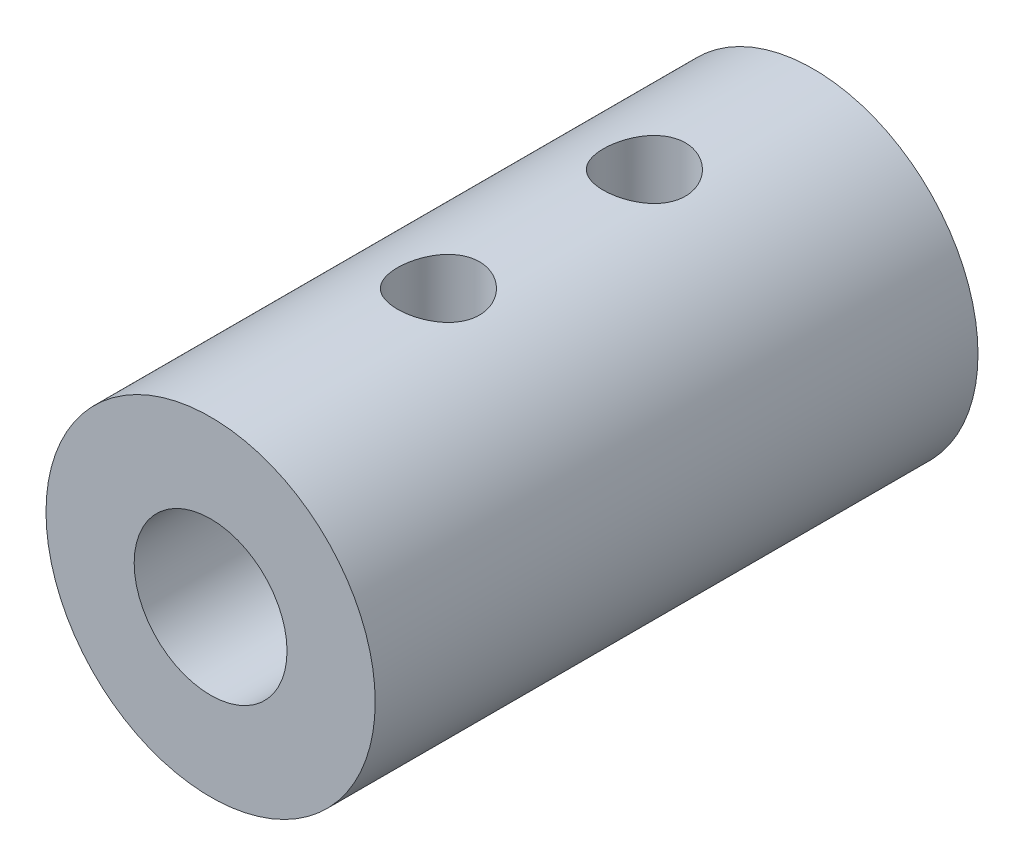
ISO-10303-21;
HEADER;
FILE_DESCRIPTION(('STEP AP214'),'2;1');
FILE_NAME('part.step','',(''),(''),'','','');
FILE_SCHEMA(('AUTOMOTIVE_DESIGN { 1 0 10303 214 1 1 1 1 }'));
ENDSEC;
DATA;
#1=APPLICATION_CONTEXT('core data for automotive mechanical design processes');
#2=APPLICATION_PROTOCOL_DEFINITION('international standard','automotive_design',2000,#1);
#3=PRODUCT_CONTEXT('',#1,'mechanical');
#4=PRODUCT('Part','Part','',(#3));
#5=PRODUCT_RELATED_PRODUCT_CATEGORY('part','',(#4));
#6=PRODUCT_DEFINITION_FORMATION('','',#4);
#7=PRODUCT_DEFINITION_CONTEXT('part definition',#1,'design');
#8=PRODUCT_DEFINITION('design','',#6,#7);
#9=PRODUCT_DEFINITION_SHAPE('','',#8);
#10=(LENGTH_UNIT() NAMED_UNIT(*) SI_UNIT(.MILLI.,.METRE.));
#11=(NAMED_UNIT(*) PLANE_ANGLE_UNIT() SI_UNIT($,.RADIAN.));
#12=(NAMED_UNIT(*) SI_UNIT($,.STERADIAN.) SOLID_ANGLE_UNIT());
#13=UNCERTAINTY_MEASURE_WITH_UNIT(LENGTH_MEASURE(1.E-05),#10,'distance_accuracy_value','');
#14=(GEOMETRIC_REPRESENTATION_CONTEXT(3) GLOBAL_UNCERTAINTY_ASSIGNED_CONTEXT((#13)) GLOBAL_UNIT_ASSIGNED_CONTEXT((#10,
#11,#12)) REPRESENTATION_CONTEXT('',''));
#15=CARTESIAN_POINT('',(0.,0.,0.));
#16=DIRECTION('',(0.,0.,1.));
#17=DIRECTION('',(1.,0.,0.));
#18=AXIS2_PLACEMENT_3D('',#15,#16,#17);
#19=CARTESIAN_POINT('',(0.,0.,37.3471918985787));
#20=DIRECTION('',(0.,0.,-1.));
#21=DIRECTION('',(-1.,0.,0.));
#22=AXIS2_PLACEMENT_3D('',#19,#20,#21);
#23=CYLINDRICAL_SURFACE('',#22,5.6);
#24=CARTESIAN_POINT('',(0.,0.,11.508));
#25=DIRECTION('',(0.,0.,1.));
#26=DIRECTION('',(1.,0.,0.));
#27=AXIS2_PLACEMENT_3D('',#24,#25,#26);
#28=CIRCLE('',#27,5.6);
#29=CARTESIAN_POINT('',(5.6,0.,11.508));
#30=VERTEX_POINT('',#29);
#31=EDGE_CURVE('E11',#30,#30,#28,.T.);
#32=ORIENTED_EDGE('',*,*,#31,.F.);
#33=EDGE_LOOP('',(#32));
#34=FACE_BOUND('',#33,.T.);
#35=CARTESIAN_POINT('',(0.,0.,-8.99999999999996));
#36=DIRECTION('',(0.,0.,-1.));
#37=DIRECTION('',(-1.,0.,0.));
#38=AXIS2_PLACEMENT_3D('',#35,#36,#37);
#39=CIRCLE('',#38,5.6);
#40=CARTESIAN_POINT('',(-5.6,0.,-8.99999999999996));
#41=VERTEX_POINT('',#40);
#42=EDGE_CURVE('E53',#41,#41,#39,.F.);
#43=ORIENTED_EDGE('',*,*,#42,.T.);
#44=EDGE_LOOP('',(#43));
#45=FACE_BOUND('',#44,.T.);
#46=CARTESIAN_POINT('',(0.,5.6,-4.647));
#47=CARTESIAN_POINT('',(-0.0771906394890673,5.5999986912634,-4.64699782414014));
#48=CARTESIAN_POINT('',(-0.154405618136777,5.59838809489114,-4.64058077305841));
#49=CARTESIAN_POINT('',(-0.306622950692055,5.59211916223095,-4.61512034743457));
#50=CARTESIAN_POINT('',(-0.381624019199655,5.58745909042396,-4.59606978281783));
#51=CARTESIAN_POINT('',(-0.527193366146127,5.57560728760345,-4.54599133850209));
#52=CARTESIAN_POINT('',(-0.597766838018763,5.56841859058187,-4.51497780837697));
#53=CARTESIAN_POINT('',(-0.732709341429523,5.55227532376652,-4.44190418636239));
#54=CARTESIAN_POINT('',(-0.797078170095437,5.54332069626155,-4.39984373344086));
#55=CARTESIAN_POINT('',(-0.919104743451147,5.52441247967048,-4.30495879392043));
#56=CARTESIAN_POINT('',(-0.976617075992774,5.51444353138356,-4.25195035158564));
#57=CARTESIAN_POINT('',(-1.08203432736043,5.49473238702659,-4.1370680177483));
#58=CARTESIAN_POINT('',(-1.12993816587729,5.4849902165625,-4.07519313070652));
#59=CARTESIAN_POINT('',(-1.21546173854179,5.46668088386241,-3.94320621423932));
#60=CARTESIAN_POINT('',(-1.25291895132595,5.45813322363498,-3.8729859246736));
#61=CARTESIAN_POINT('',(-1.31544089489894,5.44340463614382,-3.72699757571381));
#62=CARTESIAN_POINT('',(-1.34050759760442,5.43722333231611,-3.65123040129669));
#63=CARTESIAN_POINT('',(-1.37704118507533,5.42808515921467,-3.49789758739659));
#64=CARTESIAN_POINT('',(-1.38876945169102,5.42506641269778,-3.42039799892529));
#65=CARTESIAN_POINT('',(-1.39910738147621,5.42240992024599,-3.26447699599674));
#66=CARTESIAN_POINT('',(-1.39771916919201,5.42277162676092,-3.18605573288324));
#67=CARTESIAN_POINT('',(-1.38207212537688,5.42677954361279,-3.03251966150201));
#68=CARTESIAN_POINT('',(-1.3681246188943,5.43034630135678,-2.95737072790602));
#69=CARTESIAN_POINT('',(-1.32825147552581,5.44023583433874,-2.81051455593223));
#70=CARTESIAN_POINT('',(-1.30232498856813,5.44655880516576,-2.73880756220564));
#71=CARTESIAN_POINT('',(-1.23896415991791,5.4613213489532,-2.60003522833169));
#72=CARTESIAN_POINT('',(-1.20141670862314,5.46978156858398,-2.53302382053084));
#73=CARTESIAN_POINT('',(-1.1159589002348,5.48785368212866,-2.40614105421971));
#74=CARTESIAN_POINT('',(-1.06804673691324,5.49746577664602,-2.34627094302706));
#75=CARTESIAN_POINT('',(-0.961606287656554,5.51709324881977,-2.23358603062662));
#76=CARTESIAN_POINT('',(-0.902815246538383,5.52711232876791,-2.18101975840478));
#77=CARTESIAN_POINT('',(-0.77713242118142,5.54617877344946,-2.08644539668774));
#78=CARTESIAN_POINT('',(-0.710240391671059,5.55522610874594,-2.04443762698813));
#79=CARTESIAN_POINT('',(-0.569900730139629,5.57137439283227,-1.97208199871661));
#80=CARTESIAN_POINT('',(-0.49643153206408,5.57846860277099,-1.9417743679107));
#81=CARTESIAN_POINT('',(-0.345224709583008,5.5898622830447,-1.89400890442387));
#82=CARTESIAN_POINT('',(-0.267487901104818,5.59416228560196,-1.87654862458008));
#83=CARTESIAN_POINT('',(-0.112077530244661,5.59940435255174,-1.85535272405126));
#84=CARTESIAN_POINT('',(-0.0344528549184977,5.60042920923909,-1.85127863779072));
#85=CARTESIAN_POINT('',(0.12036915129207,5.59924124976359,-1.85604264989652));
#86=CARTESIAN_POINT('',(0.197566519847013,5.59702872371668,-1.86487959124951));
#87=CARTESIAN_POINT('',(0.348167407114402,5.58966764189513,-1.89493579308405));
#88=CARTESIAN_POINT('',(0.421610084661956,5.58456286363719,-1.91597053509494));
#89=CARTESIAN_POINT('',(0.563920653167383,5.57199257102266,-1.96961458483585));
#90=CARTESIAN_POINT('',(0.632788082432266,5.56452681885431,-2.00222505858503));
#91=CARTESIAN_POINT('',(0.765340852461428,5.54786432868585,-2.07875173069168));
#92=CARTESIAN_POINT('',(0.828913009801268,5.53863931332559,-2.12285767058349));
#93=CARTESIAN_POINT('',(0.947873803513739,5.51952638552373,-2.2208806058081));
#94=CARTESIAN_POINT('',(1.00326103096931,5.5096383593793,-2.27479928670574));
#95=CARTESIAN_POINT('',(1.10567348998674,5.49001604620664,-2.3924883340194));
#96=CARTESIAN_POINT('',(1.15246134912474,5.48029141830889,-2.45646721821947));
#97=CARTESIAN_POINT('',(1.23463625445289,5.46236662414236,-2.59156823982417));
#98=CARTESIAN_POINT('',(1.27002380718627,5.45416639014792,-2.66269005966662));
#99=CARTESIAN_POINT('',(1.32813040068414,5.44030902963127,-2.80967627215993));
#100=CARTESIAN_POINT('',(1.35092450376185,5.43463687474282,-2.88550950029784));
#101=CARTESIAN_POINT('',(1.38339545230448,5.42646318014645,-3.04009483540485));
#102=CARTESIAN_POINT('',(1.39307515181193,5.42396095058629,-3.11884630345359));
#103=CARTESIAN_POINT('',(1.39889388110788,5.42246283846187,-3.27461756407507));
#104=CARTESIAN_POINT('',(1.39541224520931,5.42336872400647,-3.35162246941418));
#105=CARTESIAN_POINT('',(1.37587493798472,5.42835774550216,-3.50391001613572));
#106=CARTESIAN_POINT('',(1.35981951726125,5.43244081813012,-3.57919269181239));
#107=CARTESIAN_POINT('',(1.31579716029808,5.44326952546561,-3.72548834976932));
#108=CARTESIAN_POINT('',(1.2879010836153,5.44999930383421,-3.79652390900075));
#109=CARTESIAN_POINT('',(1.22104541152127,5.46536543990012,-3.93295707299726));
#110=CARTESIAN_POINT('',(1.18208428815223,5.47400206087414,-3.99835389748987));
#111=CARTESIAN_POINT('',(1.09301398658711,5.49248912380743,-4.12348694277732));
#112=CARTESIAN_POINT('',(1.04264146867888,5.50236527233613,-4.18303195043254));
#113=CARTESIAN_POINT('',(0.932691826569096,5.52206479773609,-4.29294739489624));
#114=CARTESIAN_POINT('',(0.873112521108676,5.5318881615295,-4.34331565138406));
#115=CARTESIAN_POINT('',(0.745145361895293,5.55058640746723,-4.43433212200741));
#116=CARTESIAN_POINT('',(0.676618180044349,5.55944101894235,-4.47478892117678));
#117=CARTESIAN_POINT('',(0.533520728873584,5.5749904371124,-4.54354382737188));
#118=CARTESIAN_POINT('',(0.458954849517729,5.58168679547088,-4.57185067441424));
#119=CARTESIAN_POINT('',(0.32043181458895,5.59117148729737,-4.61128488631549));
#120=CARTESIAN_POINT('',(0.257136283368401,5.59445947970238,-4.62464916742115));
#121=CARTESIAN_POINT('',(0.129232789261598,5.59887420333864,-4.64250730444998));
#122=CARTESIAN_POINT('',(0.0646249245788559,5.6000010956899,-4.64700182165584));
#123=CARTESIAN_POINT('',(0.,5.6,-4.647));
#124=B_SPLINE_CURVE_WITH_KNOTS('',3,(#46,#47,#48,#49,#50,#51,#52,#53,#54,#55,#56,#57,#58,#59,
#60,#61,#62,#63,#64,#65,#66,#67,#68,#69,#70,#71,#72,#73,#74,#75,#76,#77,#78,#79,#80,#81,#82,#83,
#84,#85,#86,#87,#88,#89,#90,#91,#92,#93,#94,#95,#96,#97,#98,#99,#100,#101,#102,#103,#104,#105,
#106,#107,#108,#109,#110,#111,#112,#113,#114,#115,#116,#117,#118,#119,#120,#121,#122,#123),
.UNSPECIFIED.,.T.,.F.,(4,2,2,2,2,2,2,2,2,2,2,2,2,2,2,2,2,2,2,2,2,2,2,2,2,2,2,2,2,2,2,2,2,2,2,2,
2,2,4),(0.,0.231335096819015,0.462801965826443,0.693992049459298,0.925189689714438,
1.16064481618663,1.39612640069954,1.63508956599199,1.87401468867944,2.10817245696749,
2.34229229811865,2.57076375565459,2.79925142884196,3.03003694840813,3.26086271873615,
3.49824105639843,3.735626582902,3.97382117673023,4.21197038750843,4.44404975647206,
4.67610832906921,4.90474483291265,5.13340437376474,5.36610773655014,5.5988511093042,
5.83728108369588,6.07570046260479,6.31268299240665,6.54961394022724,6.77976886789034,
7.00991920855418,7.2387112299762,7.46753486036312,7.70230359108804,7.93712802840065,
8.17618205185456,8.41506382343315,8.60875476837786,8.80243127220432),.UNSPECIFIED.);
#125=CARTESIAN_POINT('',(0.,5.6,-4.647));
#126=VERTEX_POINT('',#125);
#127=EDGE_CURVE('E61',#126,#126,#124,.T.);
#128=ORIENTED_EDGE('',*,*,#127,.F.);
#129=EDGE_LOOP('',(#128));
#130=FACE_BOUND('',#129,.T.);
#131=CARTESIAN_POINT('',(0.,5.6,2.36100000000002));
#132=CARTESIAN_POINT('',(-0.0771906394890673,5.5999986912634,2.36100217585988));
#133=CARTESIAN_POINT('',(-0.154405618136777,5.59838809489114,2.36741922694162));
#134=CARTESIAN_POINT('',(-0.306622950692055,5.59211916223095,2.39287965256545));
#135=CARTESIAN_POINT('',(-0.381624019199655,5.58745909042396,2.41193021718219));
#136=CARTESIAN_POINT('',(-0.527193366146127,5.57560728760345,2.46200866149793));
#137=CARTESIAN_POINT('',(-0.597766838018763,5.56841859058187,2.49302219162306));
#138=CARTESIAN_POINT('',(-0.732709341429523,5.55227532376652,2.56609581363763));
#139=CARTESIAN_POINT('',(-0.797078170095437,5.54332069626155,2.60815626655916));
#140=CARTESIAN_POINT('',(-0.919104743451147,5.52441247967048,2.7030412060796));
#141=CARTESIAN_POINT('',(-0.976617075992774,5.51444353138356,2.75604964841439));
#142=CARTESIAN_POINT('',(-1.08203432736043,5.49473238702659,2.87093198225172));
#143=CARTESIAN_POINT('',(-1.12993816587729,5.4849902165625,2.9328068692935));
#144=CARTESIAN_POINT('',(-1.21546173854179,5.46668088386241,3.0647937857607));
#145=CARTESIAN_POINT('',(-1.25291895132595,5.45813322363498,3.13501407532642));
#146=CARTESIAN_POINT('',(-1.31544089489894,5.44340463614382,3.28100242428621));
#147=CARTESIAN_POINT('',(-1.34050759760442,5.43722333231611,3.35676959870333));
#148=CARTESIAN_POINT('',(-1.37704118507533,5.42808515921467,3.51010241260343));
#149=CARTESIAN_POINT('',(-1.38876945169102,5.42506641269778,3.58760200107473));
#150=CARTESIAN_POINT('',(-1.39910738147621,5.42240992024599,3.74352300400328));
#151=CARTESIAN_POINT('',(-1.39771916919201,5.42277162676092,3.82194426711678));
#152=CARTESIAN_POINT('',(-1.38207212537688,5.42677954361279,3.97548033849801));
#153=CARTESIAN_POINT('',(-1.3681246188943,5.43034630135678,4.050629272094));
#154=CARTESIAN_POINT('',(-1.32825147552581,5.44023583433874,4.19748544406779));
#155=CARTESIAN_POINT('',(-1.30232498856814,5.44655880516576,4.26919243779438));
#156=CARTESIAN_POINT('',(-1.23896415991791,5.4613213489532,4.40796477166833));
#157=CARTESIAN_POINT('',(-1.20141670862314,5.46978156858398,4.47497617946918));
#158=CARTESIAN_POINT('',(-1.1159589002348,5.48785368212866,4.60185894578031));
#159=CARTESIAN_POINT('',(-1.06804673691324,5.49746577664602,4.66172905697297));
#160=CARTESIAN_POINT('',(-0.961606287656554,5.51709324881977,4.7744139693734));
#161=CARTESIAN_POINT('',(-0.902815246538383,5.52711232876791,4.82698024159524));
#162=CARTESIAN_POINT('',(-0.77713242118142,5.54617877344946,4.92155460331228));
#163=CARTESIAN_POINT('',(-0.710240391671059,5.55522610874594,4.96356237301189));
#164=CARTESIAN_POINT('',(-0.56990073013963,5.57137439283227,5.03591800128341));
#165=CARTESIAN_POINT('',(-0.49643153206408,5.57846860277099,5.06622563208932));
#166=CARTESIAN_POINT('',(-0.345224709583009,5.5898622830447,5.11399109557615));
#167=CARTESIAN_POINT('',(-0.267487901104819,5.59416228560196,5.13145137541994));
#168=CARTESIAN_POINT('',(-0.112077530244662,5.59940435255174,5.15264727594876));
#169=CARTESIAN_POINT('',(-0.0344528549184986,5.60042920923909,5.15672136220931));
#170=CARTESIAN_POINT('',(0.120369151292069,5.59924124976359,5.1519573501035));
#171=CARTESIAN_POINT('',(0.197566519847013,5.59702872371668,5.14312040875051));
#172=CARTESIAN_POINT('',(0.348167407114402,5.58966764189513,5.11306420691597));
#173=CARTESIAN_POINT('',(0.421610084661956,5.58456286363719,5.09202946490508));
#174=CARTESIAN_POINT('',(0.563920653167383,5.57199257102266,5.03838541516417));
#175=CARTESIAN_POINT('',(0.632788082432266,5.56452681885431,5.00577494141499));
#176=CARTESIAN_POINT('',(0.765340852461428,5.54786432868585,4.92924826930835));
#177=CARTESIAN_POINT('',(0.828913009801268,5.53863931332559,4.88514232941653));
#178=CARTESIAN_POINT('',(0.947873803513739,5.51952638552373,4.78711939419192));
#179=CARTESIAN_POINT('',(1.00326103096931,5.5096383593793,4.73320071329428));
#180=CARTESIAN_POINT('',(1.10567348998674,5.49001604620664,4.61551166598062));
#181=CARTESIAN_POINT('',(1.15246134912474,5.48029141830889,4.55153278178055));
#182=CARTESIAN_POINT('',(1.23463625445289,5.46236662414236,4.41643176017585));
#183=CARTESIAN_POINT('',(1.27002380718627,5.45416639014792,4.3453099403334));
#184=CARTESIAN_POINT('',(1.32813040068414,5.44030902963127,4.19832372784009));
#185=CARTESIAN_POINT('',(1.35092450376185,5.43463687474282,4.12249049970218));
#186=CARTESIAN_POINT('',(1.38339545230448,5.42646318014645,3.96790516459517));
#187=CARTESIAN_POINT('',(1.39307515181193,5.42396095058629,3.88915369654643));
#188=CARTESIAN_POINT('',(1.39889388110788,5.42246283846187,3.73338243592495));
#189=CARTESIAN_POINT('',(1.39541224520931,5.42336872400647,3.65637753058584));
#190=CARTESIAN_POINT('',(1.37587493798472,5.42835774550216,3.5040899838643));
#191=CARTESIAN_POINT('',(1.35981951726125,5.43244081813012,3.42880730818764));
#192=CARTESIAN_POINT('',(1.31579716029808,5.44326952546561,3.2825116502307));
#193=CARTESIAN_POINT('',(1.2879010836153,5.44999930383421,3.21147609099927));
#194=CARTESIAN_POINT('',(1.22104541152127,5.46536543990012,3.07504292700276));
#195=CARTESIAN_POINT('',(1.18208428815223,5.47400206087414,3.00964610251015));
#196=CARTESIAN_POINT('',(1.09301398658711,5.49248912380743,2.8845130572227));
#197=CARTESIAN_POINT('',(1.04264146867888,5.50236527233613,2.82496804956748));
#198=CARTESIAN_POINT('',(0.932691826569096,5.52206479773609,2.71505260510378));
#199=CARTESIAN_POINT('',(0.873112521108676,5.5318881615295,2.66468434861596));
#200=CARTESIAN_POINT('',(0.745145361895294,5.55058640746723,2.57366787799261));
#201=CARTESIAN_POINT('',(0.67661818004435,5.55944101894235,2.53321107882325));
#202=CARTESIAN_POINT('',(0.533520728873585,5.5749904371124,2.46445617262815));
#203=CARTESIAN_POINT('',(0.45895484951773,5.58168679547088,2.43614932558578));
#204=CARTESIAN_POINT('',(0.32043181458895,5.59117148729737,2.39671511368453));
#205=CARTESIAN_POINT('',(0.257136283368401,5.59445947970238,2.38335083257887));
#206=CARTESIAN_POINT('',(0.129232789261598,5.59887420333864,2.36549269555004));
#207=CARTESIAN_POINT('',(0.0646249245788557,5.6000010956899,2.36099817834418));
#208=CARTESIAN_POINT('',(0.,5.6,2.36100000000002));
#209=B_SPLINE_CURVE_WITH_KNOTS('',3,(#131,#132,#133,#134,#135,#136,#137,#138,#139,#140,#141,
#142,#143,#144,#145,#146,#147,#148,#149,#150,#151,#152,#153,#154,#155,#156,#157,#158,#159,#160,
#161,#162,#163,#164,#165,#166,#167,#168,#169,#170,#171,#172,#173,#174,#175,#176,#177,#178,#179,
#180,#181,#182,#183,#184,#185,#186,#187,#188,#189,#190,#191,#192,#193,#194,#195,#196,#197,#198,
#199,#200,#201,#202,#203,#204,#205,#206,#207,#208),.UNSPECIFIED.,.T.,.F.,(4,2,2,2,2,2,2,2,2,2,2,
2,2,2,2,2,2,2,2,2,2,2,2,2,2,2,2,2,2,2,2,2,2,2,2,2,2,2,4),(0.,0.231335096819015,
0.462801965826443,0.693992049459298,0.925189689714438,1.16064481618663,1.39612640069954,
1.63508956599199,1.87401468867944,2.10817245696749,2.34229229811865,2.57076375565459,
2.79925142884196,3.03003694840813,3.26086271873615,3.49824105639843,3.735626582902,
3.97382117673023,4.21197038750843,4.44404975647206,4.67610832906921,4.90474483291265,
5.13340437376474,5.36610773655014,5.5988511093042,5.83728108369588,6.07570046260479,
6.31268299240665,6.54961394022724,6.77976886789034,7.00991920855418,7.2387112299762,
7.46753486036312,7.70230359108804,7.93712802840065,8.17618205185456,8.41506382343315,
8.60875476837787,8.80243127220433),.UNSPECIFIED.);
#210=CARTESIAN_POINT('',(0.,5.6,2.36100000000002));
#211=VERTEX_POINT('',#210);
#212=EDGE_CURVE('E80',#211,#211,#209,.T.);
#213=ORIENTED_EDGE('',*,*,#212,.F.);
#214=EDGE_LOOP('',(#213));
#215=FACE_BOUND('',#214,.T.);
#216=ADVANCED_FACE('F33',(#34,#45,#130,#215),#23,.T.);
#217=CARTESIAN_POINT('',(0.,0.,37.3471918985787));
#218=DIRECTION('',(0.,0.,-1.));
#219=DIRECTION('',(-1.,0.,0.));
#220=AXIS2_PLACEMENT_3D('',#217,#218,#219);
#221=CYLINDRICAL_SURFACE('',#220,2.6);
#222=CARTESIAN_POINT('',(0.,2.6,-4.647));
#223=CARTESIAN_POINT('',(-0.072769895165473,2.59999579119213,-4.64699529577906));
#224=CARTESIAN_POINT('',(-0.145606030925508,2.59691338447046,-4.64128107714922));
#225=CARTESIAN_POINT('',(-0.28908326429932,2.58488603999971,-4.61869741225114));
#226=CARTESIAN_POINT('',(-0.359720889795642,2.57593227737285,-4.60181117365741));
#227=CARTESIAN_POINT('',(-0.496515899773685,2.55308893756631,-4.55775545238023));
#228=CARTESIAN_POINT('',(-0.56269022632142,2.53921944057056,-4.53062777578486));
#229=CARTESIAN_POINT('',(-0.689425354537518,2.5077803189541,-4.46709970581232));
#230=CARTESIAN_POINT('',(-0.749986078161656,2.49021064290204,-4.43069918354394));
#231=CARTESIAN_POINT('',(-0.868319706756137,2.45156055012019,-4.34691896360525));
#232=CARTESIAN_POINT('',(-0.925636772471954,2.4303240827856,-4.29896863565869));
#233=CARTESIAN_POINT('',(-1.03184460766959,2.38717180802375,-4.19469699762893));
#234=CARTESIAN_POINT('',(-1.08072788041353,2.3652554164218,-4.13836832205516));
#235=CARTESIAN_POINT('',(-1.17326125046995,2.32084675749418,-4.0126969941579));
#236=CARTESIAN_POINT('',(-1.21600298058385,2.29849021752899,-3.94263142558652));
#237=CARTESIAN_POINT('',(-1.28892483720699,2.25840967277517,-3.79501660510617));
#238=CARTESIAN_POINT('',(-1.31911473395999,2.24068206887426,-3.71747323200246));
#239=CARTESIAN_POINT('',(-1.36396684221414,2.21365006534319,-3.56197375161698));
#240=CARTESIAN_POINT('',(-1.3794841716202,2.2038871084262,-3.48434855586616));
#241=CARTESIAN_POINT('',(-1.3971099605198,2.1927621827517,-3.32703717473139));
#242=CARTESIAN_POINT('',(-1.39923587313746,2.19138927925052,-3.24735380791539));
#243=CARTESIAN_POINT('',(-1.39064216640093,2.19684342759398,-3.10052529491423));
#244=CARTESIAN_POINT('',(-1.38172080948023,2.20252288261564,-3.03322068213881));
#245=CARTESIAN_POINT('',(-1.35445010763409,2.21939623927981,-2.90126652971602));
#246=CARTESIAN_POINT('',(-1.33609685771996,2.23059242487781,-2.83661810176309));
#247=CARTESIAN_POINT('',(-1.29021112487549,2.25744795462519,-2.70999593218404));
#248=CARTESIAN_POINT('',(-1.26248322414792,2.27320118729469,-2.64811388391822));
#249=CARTESIAN_POINT('',(-1.19879793080756,2.30742050369086,-2.52956577654765));
#250=CARTESIAN_POINT('',(-1.1628369093769,2.32588778236732,-2.47290203294372));
#251=CARTESIAN_POINT('',(-1.07745865373946,2.36677861530334,-2.35748388709717));
#252=CARTESIAN_POINT('',(-1.02683352192466,2.38938092403335,-2.2996830047732));
#253=CARTESIAN_POINT('',(-0.916604027714111,2.43379754031356,-2.19295890702493));
#254=CARTESIAN_POINT('',(-0.856994074472064,2.45561134666191,-2.1440412613182));
#255=CARTESIAN_POINT('',(-0.725918029291356,2.49761034639328,-2.05360191059764));
#256=CARTESIAN_POINT('',(-0.653949211220483,2.51761379250893,-2.01271721907654));
#257=CARTESIAN_POINT('',(-0.502817137429197,2.55208951741894,-1.94399206947719));
#258=CARTESIAN_POINT('',(-0.423660463311279,2.56656679430764,-1.91613981914977));
#259=CARTESIAN_POINT('',(-0.268079244077621,2.58722317905881,-1.87683413789949));
#260=CARTESIAN_POINT('',(-0.19205782524936,2.59403571110972,-1.864122705505));
#261=CARTESIAN_POINT('',(-0.0386721545273292,2.60084289109979,-1.8514204915461));
#262=CARTESIAN_POINT('',(0.0386912749430812,2.60084157675207,-1.85142217650996));
#263=CARTESIAN_POINT('',(0.184932978676334,2.59435233043972,-1.86353258944169));
#264=CARTESIAN_POINT('',(0.25393501578734,2.58846349965524,-1.87452312273953));
#265=CARTESIAN_POINT('',(0.388946323352982,2.5716434357057,-1.90644403742637));
#266=CARTESIAN_POINT('',(0.454955283777734,2.56071168148731,-1.92737544594963));
#267=CARTESIAN_POINT('',(0.584015609667829,2.53443720810214,-1.97898262692619));
#268=CARTESIAN_POINT('',(0.64695559725862,2.51899342403604,-2.00988357794559));
#269=CARTESIAN_POINT('',(0.766934706676118,2.48509632468519,-2.08027198465099));
#270=CARTESIAN_POINT('',(0.823971546065264,2.46664185237768,-2.119762743396));
#271=CARTESIAN_POINT('',(0.93712502784454,2.4260646527298,-2.21112888043786));
#272=CARTESIAN_POINT('',(0.992467365718181,2.40376124742218,-2.26388395596507));
#273=CARTESIAN_POINT('',(1.09391823659465,2.35932547680204,-2.37777508230013));
#274=CARTESIAN_POINT('',(1.1400179559369,2.33719329391439,-2.43891903997433));
#275=CARTESIAN_POINT('',(1.22480288195043,2.29396561105571,-2.57310026461105));
#276=CARTESIAN_POINT('',(1.26274674236957,2.27305006616512,-2.6466695978749));
#277=CARTESIAN_POINT('',(1.32533377396088,2.23714274497908,-2.80058385037707));
#278=CARTESIAN_POINT('',(1.34999602471657,2.2221424794842,-2.88091885742595));
#279=CARTESIAN_POINT('',(1.38287545182504,2.20181685289185,-3.0377740579305));
#280=CARTESIAN_POINT('',(1.39246552631014,2.19568849426518,-3.11389847716744));
#281=CARTESIAN_POINT('',(1.39898999659858,2.19154024993134,-3.26688709800002));
#282=CARTESIAN_POINT('',(1.39593350629986,2.19351452495615,-3.34375072703384));
#283=CARTESIAN_POINT('',(1.37857756869333,2.20445026794735,-3.48581175616345));
#284=CARTESIAN_POINT('',(1.36573059183356,2.21250789797849,-3.55126685344851));
#285=CARTESIAN_POINT('',(1.33115580994945,2.23347947650339,-3.67896580633621));
#286=CARTESIAN_POINT('',(1.30942463671249,2.24639526669395,-3.7412084339235));
#287=CARTESIAN_POINT('',(1.25619256299538,2.27661383584126,-3.86516500233428));
#288=CARTESIAN_POINT('',(1.22415690770995,2.29414389322957,-3.92659197712035));
#289=CARTESIAN_POINT('',(1.1517512859744,2.33133556893673,-4.04361081859353));
#290=CARTESIAN_POINT('',(1.11137683810421,2.35099833070073,-4.09919952335434));
#291=CARTESIAN_POINT('',(1.01649137362266,2.39370680331335,-4.21152256126266));
#292=CARTESIAN_POINT('',(0.960773548432199,2.41682364460219,-4.26721605276333));
#293=CARTESIAN_POINT('',(0.840315961259245,2.46129859591344,-4.36878782767751));
#294=CARTESIAN_POINT('',(0.775570262075972,2.48265553370521,-4.41465960106547));
#295=CARTESIAN_POINT('',(0.636493976233791,2.52195015115623,-4.49625619524297));
#296=CARTESIAN_POINT('',(0.561954082809038,2.5397816483187,-4.53167832149028));
#297=CARTESIAN_POINT('',(0.406795413853645,2.56918347459121,-4.589001092626));
#298=CARTESIAN_POINT('',(0.326193368199628,2.58077036331524,-4.61093752121483));
#299=CARTESIAN_POINT('',(0.2038736853605,2.59231143904982,-4.63264867436325));
#300=CARTESIAN_POINT('',(0.163347584136325,2.59518428529999,-4.63801987882477));
#301=CARTESIAN_POINT('',(0.0818879841676505,2.59902975689327,-4.64519687810324));
#302=CARTESIAN_POINT('',(0.0409544825216311,2.6000023686931,-4.64700264750875));
#303=CARTESIAN_POINT('',(0.,2.6,-4.647));
#304=B_SPLINE_CURVE_WITH_KNOTS('',3,(#222,#223,#224,#225,#226,#227,#228,#229,#230,#231,#232,
#233,#234,#235,#236,#237,#238,#239,#240,#241,#242,#243,#244,#245,#246,#247,#248,#249,#250,#251,
#252,#253,#254,#255,#256,#257,#258,#259,#260,#261,#262,#263,#264,#265,#266,#267,#268,#269,#270,
#271,#272,#273,#274,#275,#276,#277,#278,#279,#280,#281,#282,#283,#284,#285,#286,#287,#288,#289,
#290,#291,#292,#293,#294,#295,#296,#297,#298,#299,#300,#301,#302,#303),.UNSPECIFIED.,.T.,.F.,(4,
2,2,2,2,2,2,2,2,2,2,2,2,2,2,2,2,2,2,2,2,2,2,2,2,2,2,2,2,2,2,2,2,2,2,2,2,2,2,2,4),(0.,
0.218144531802238,0.436617697239384,0.654208521035589,0.871802369477666,1.10391901161361,
1.33624092927498,1.59015078661564,1.84386263090616,2.08166204749626,2.31915147426269,
2.52258628596971,2.72610539161524,2.93415926827227,3.14230502358784,3.38156330693519,
3.62097108921132,3.87505143986584,4.12890144222991,4.35973273463965,4.59042724227603,
4.79981530431216,5.00922500593765,5.22374137097314,5.43834037078061,5.6762719118765,
5.91442927391277,6.16919649461855,6.42359674871911,6.65310657978069,6.88245104066011,
7.0831399902349,7.28390509648275,7.49747619443116,7.71116236946208,7.95637313973777,
8.2017459407555,8.45365206271623,8.70488684487634,8.82765646988664,8.95042696989312),.UNSPECIFIED.);
#305=CARTESIAN_POINT('',(0.,2.6,-4.647));
#306=VERTEX_POINT('',#305);
#307=EDGE_CURVE('E55',#306,#306,#304,.T.);
#308=ORIENTED_EDGE('',*,*,#307,.T.);
#309=EDGE_LOOP('',(#308));
#310=FACE_BOUND('',#309,.T.);
#311=CARTESIAN_POINT('',(0.,0.,11.508));
#312=DIRECTION('',(0.,0.,1.));
#313=DIRECTION('',(1.,0.,0.));
#314=AXIS2_PLACEMENT_3D('',#311,#312,#313);
#315=CIRCLE('',#314,2.6);
#316=CARTESIAN_POINT('',(2.6,0.,11.508));
#317=VERTEX_POINT('',#316);
#318=EDGE_CURVE('E45',#317,#317,#315,.T.);
#319=ORIENTED_EDGE('',*,*,#318,.T.);
#320=EDGE_LOOP('',(#319));
#321=FACE_BOUND('',#320,.T.);
#322=CARTESIAN_POINT('',(0.,0.,-8.99999999999996));
#323=DIRECTION('',(0.,0.,-1.));
#324=DIRECTION('',(-1.,0.,0.));
#325=AXIS2_PLACEMENT_3D('',#322,#323,#324);
#326=CIRCLE('',#325,2.6);
#327=CARTESIAN_POINT('',(-2.6,0.,-8.99999999999996));
#328=VERTEX_POINT('',#327);
#329=EDGE_CURVE('E50',#328,#328,#326,.F.);
#330=ORIENTED_EDGE('',*,*,#329,.F.);
#331=EDGE_LOOP('',(#330));
#332=FACE_BOUND('',#331,.T.);
#333=CARTESIAN_POINT('',(0.,2.6,2.36100000000002));
#334=CARTESIAN_POINT('',(-0.072769895165473,2.59999579119213,2.36100470422096));
#335=CARTESIAN_POINT('',(-0.145606030925508,2.59691338447046,2.36671892285081));
#336=CARTESIAN_POINT('',(-0.28908326429932,2.58488603999971,2.38930258774888));
#337=CARTESIAN_POINT('',(-0.359720889795642,2.57593227737285,2.40618882634262));
#338=CARTESIAN_POINT('',(-0.496515899773685,2.55308893756631,2.45024454761979));
#339=CARTESIAN_POINT('',(-0.56269022632142,2.53921944057056,2.47737222421516));
#340=CARTESIAN_POINT('',(-0.689425354537518,2.5077803189541,2.5409002941877));
#341=CARTESIAN_POINT('',(-0.749986078161656,2.49021064290204,2.57730081645608));
#342=CARTESIAN_POINT('',(-0.868319706756138,2.45156055012019,2.66108103639477));
#343=CARTESIAN_POINT('',(-0.925636772471954,2.4303240827856,2.70903136434133));
#344=CARTESIAN_POINT('',(-1.03184460766959,2.38717180802375,2.81330300237109));
#345=CARTESIAN_POINT('',(-1.08072788041353,2.3652554164218,2.86963167794486));
#346=CARTESIAN_POINT('',(-1.17326125046995,2.32084675749418,2.99530300584212));
#347=CARTESIAN_POINT('',(-1.21600298058385,2.29849021752899,3.0653685744135));
#348=CARTESIAN_POINT('',(-1.28892483720699,2.25840967277517,3.21298339489385));
#349=CARTESIAN_POINT('',(-1.31911473395999,2.24068206887426,3.29052676799756));
#350=CARTESIAN_POINT('',(-1.36396684221414,2.21365006534319,3.44602624838304));
#351=CARTESIAN_POINT('',(-1.3794841716202,2.2038871084262,3.52365144413386));
#352=CARTESIAN_POINT('',(-1.3971099605198,2.1927621827517,3.68096282526863));
#353=CARTESIAN_POINT('',(-1.39923587313746,2.19138927925052,3.76064619208463));
#354=CARTESIAN_POINT('',(-1.39064216640093,2.19684342759398,3.90747470508579));
#355=CARTESIAN_POINT('',(-1.38172080948023,2.20252288261563,3.97477931786121));
#356=CARTESIAN_POINT('',(-1.35445010763409,2.21939623927981,4.106733470284));
#357=CARTESIAN_POINT('',(-1.33609685771996,2.23059242487781,4.17138189823693));
#358=CARTESIAN_POINT('',(-1.29021112487549,2.25744795462519,4.29800406781599));
#359=CARTESIAN_POINT('',(-1.26248322414792,2.27320118729469,4.3598861160818));
#360=CARTESIAN_POINT('',(-1.19879793080756,2.30742050369086,4.47843422345237));
#361=CARTESIAN_POINT('',(-1.1628369093769,2.32588778236732,4.5350979670563));
#362=CARTESIAN_POINT('',(-1.07745865373946,2.36677861530334,4.65051611290285));
#363=CARTESIAN_POINT('',(-1.02683352192466,2.38938092403335,4.70831699522682));
#364=CARTESIAN_POINT('',(-0.916604027714111,2.43379754031356,4.8150410929751));
#365=CARTESIAN_POINT('',(-0.856994074472064,2.45561134666191,4.86395873868182));
#366=CARTESIAN_POINT('',(-0.725918029291357,2.49761034639328,4.95439808940238));
#367=CARTESIAN_POINT('',(-0.653949211220483,2.51761379250893,4.99528278092348));
#368=CARTESIAN_POINT('',(-0.502817137429197,2.55208951741894,5.06400793052283));
#369=CARTESIAN_POINT('',(-0.42366046331128,2.56656679430764,5.09186018085026));
#370=CARTESIAN_POINT('',(-0.268079244077621,2.58722317905881,5.13116586210053));
#371=CARTESIAN_POINT('',(-0.192057825249361,2.59403571110972,5.14387729449502));
#372=CARTESIAN_POINT('',(-0.0386721545273296,2.60084289109979,5.15657950845392));
#373=CARTESIAN_POINT('',(0.038691274943081,2.60084157675207,5.15657782349006));
#374=CARTESIAN_POINT('',(0.184932978676334,2.59435233043972,5.14446741055833));
#375=CARTESIAN_POINT('',(0.253935015787339,2.58846349965524,5.13347687726049));
#376=CARTESIAN_POINT('',(0.388946323352981,2.5716434357057,5.10155596257365));
#377=CARTESIAN_POINT('',(0.454955283777734,2.56071168148731,5.08062455405039));
#378=CARTESIAN_POINT('',(0.584015609667829,2.53443720810214,5.02901737307383));
#379=CARTESIAN_POINT('',(0.64695559725862,2.51899342403604,4.99811642205443));
#380=CARTESIAN_POINT('',(0.766934706676117,2.48509632468519,4.92772801534904));
#381=CARTESIAN_POINT('',(0.823971546065263,2.46664185237768,4.88823725660402));
#382=CARTESIAN_POINT('',(0.93712502784454,2.4260646527298,4.79687111956216));
#383=CARTESIAN_POINT('',(0.992467365718181,2.40376124742218,4.74411604403495));
#384=CARTESIAN_POINT('',(1.09391823659465,2.35932547680204,4.63022491769989));
#385=CARTESIAN_POINT('',(1.1400179559369,2.33719329391439,4.5690809600257));
#386=CARTESIAN_POINT('',(1.22480288195043,2.29396561105571,4.43489973538897));
#387=CARTESIAN_POINT('',(1.26274674236957,2.27305006616512,4.36133040212512));
#388=CARTESIAN_POINT('',(1.32533377396088,2.23714274497908,4.20741614962295));
#389=CARTESIAN_POINT('',(1.34999602471657,2.2221424794842,4.12708114257407));
#390=CARTESIAN_POINT('',(1.38287545182504,2.20181685289185,3.97022594206952));
#391=CARTESIAN_POINT('',(1.39246552631014,2.19568849426518,3.89410152283258));
#392=CARTESIAN_POINT('',(1.39898999659858,2.19154024993134,3.741112902));
#393=CARTESIAN_POINT('',(1.39593350629986,2.19351452495615,3.66424927296618));
#394=CARTESIAN_POINT('',(1.37857756869333,2.20445026794735,3.52218824383657));
#395=CARTESIAN_POINT('',(1.36573059183356,2.21250789797849,3.45673314655151));
#396=CARTESIAN_POINT('',(1.33115580994945,2.23347947650339,3.32903419366381));
#397=CARTESIAN_POINT('',(1.30942463671249,2.24639526669395,3.26679156607652));
#398=CARTESIAN_POINT('',(1.25619256299538,2.27661383584126,3.14283499766574));
#399=CARTESIAN_POINT('',(1.22415690770995,2.29414389322957,3.08140802287967));
#400=CARTESIAN_POINT('',(1.1517512859744,2.33133556893673,2.96438918140649));
#401=CARTESIAN_POINT('',(1.11137683810421,2.35099833070073,2.90880047664568));
#402=CARTESIAN_POINT('',(1.01649137362266,2.39370680331335,2.79647743873736));
#403=CARTESIAN_POINT('',(0.9607735484322,2.41682364460219,2.7407839472367));
#404=CARTESIAN_POINT('',(0.840315961259246,2.46129859591344,2.63921217232252));
#405=CARTESIAN_POINT('',(0.775570262075973,2.48265553370521,2.59334039893456));
#406=CARTESIAN_POINT('',(0.636493976233792,2.52195015115622,2.51174380475705));
#407=CARTESIAN_POINT('',(0.561954082809039,2.5397816483187,2.47632167850974));
#408=CARTESIAN_POINT('',(0.406795413853645,2.56918347459121,2.41899890737402));
#409=CARTESIAN_POINT('',(0.326193368199628,2.58077036331524,2.39706247878519));
#410=CARTESIAN_POINT('',(0.2038736853605,2.59231143904982,2.37535132563677));
#411=CARTESIAN_POINT('',(0.163347584136325,2.59518428529999,2.36998012117525));
#412=CARTESIAN_POINT('',(0.0818879841676509,2.59902975689327,2.36280312189678));
#413=CARTESIAN_POINT('',(0.0409544825216313,2.6000023686931,2.36099735249127));
#414=CARTESIAN_POINT('',(0.,2.6,2.36100000000002));
#415=B_SPLINE_CURVE_WITH_KNOTS('',3,(#333,#334,#335,#336,#337,#338,#339,#340,#341,#342,#343,
#344,#345,#346,#347,#348,#349,#350,#351,#352,#353,#354,#355,#356,#357,#358,#359,#360,#361,#362,
#363,#364,#365,#366,#367,#368,#369,#370,#371,#372,#373,#374,#375,#376,#377,#378,#379,#380,#381,
#382,#383,#384,#385,#386,#387,#388,#389,#390,#391,#392,#393,#394,#395,#396,#397,#398,#399,#400,
#401,#402,#403,#404,#405,#406,#407,#408,#409,#410,#411,#412,#413,#414),.UNSPECIFIED.,.T.,.F.,(4,
2,2,2,2,2,2,2,2,2,2,2,2,2,2,2,2,2,2,2,2,2,2,2,2,2,2,2,2,2,2,2,2,2,2,2,2,2,2,2,4),(0.,
0.218144531802238,0.436617697239384,0.654208521035589,0.871802369477666,1.10391901161361,
1.33624092927498,1.59015078661564,1.84386263090616,2.08166204749626,2.31915147426269,
2.52258628596971,2.72610539161524,2.93415926827227,3.14230502358784,3.38156330693519,
3.62097108921132,3.87505143986584,4.12890144222991,4.35973273463964,4.59042724227603,
4.79981530431216,5.00922500593765,5.22374137097313,5.43834037078061,5.6762719118765,
5.91442927391277,6.16919649461855,6.42359674871911,6.65310657978068,6.88245104066011,
7.08313999023489,7.28390509648275,7.49747619443116,7.71116236946207,7.95637313973777,
8.2017459407555,8.45365206271623,8.70488684487633,8.82765646988663,8.95042696989311),.UNSPECIFIED.);
#416=CARTESIAN_POINT('',(0.,2.6,2.36100000000002));
#417=VERTEX_POINT('',#416);
#418=EDGE_CURVE('E37',#417,#417,#415,.T.);
#419=ORIENTED_EDGE('',*,*,#418,.T.);
#420=EDGE_LOOP('',(#419));
#421=FACE_BOUND('',#420,.T.);
#422=ADVANCED_FACE('F62',(#310,#321,#332,#421),#221,.F.);
#423=CARTESIAN_POINT('',(36.6538713122592,70.3311655965562,11.508));
#424=DIRECTION('',(0.,0.,1.));
#425=DIRECTION('',(0.985412445343746,-0.170183173556196,0.));
#426=AXIS2_PLACEMENT_3D('',#423,#424,#425);
#427=PLANE('',#426);
#428=ORIENTED_EDGE('',*,*,#318,.F.);
#429=EDGE_LOOP('',(#428));
#430=FACE_BOUND('',#429,.T.);
#431=ORIENTED_EDGE('',*,*,#31,.T.);
#432=EDGE_LOOP('',(#431));
#433=FACE_BOUND('',#432,.T.);
#434=ADVANCED_FACE('F94',(#430,#433),#427,.T.);
#435=CARTESIAN_POINT('',(-0.19571064958959,-1.1332243121452,-8.99999999999996));
#436=DIRECTION('',(0.,0.,-1.));
#437=DIRECTION('',(0.985412445343746,-0.170183173556196,0.));
#438=AXIS2_PLACEMENT_3D('',#435,#436,#437);
#439=PLANE('',#438);
#440=ORIENTED_EDGE('',*,*,#42,.F.);
#441=EDGE_LOOP('',(#440));
#442=FACE_BOUND('',#441,.T.);
#443=ORIENTED_EDGE('',*,*,#329,.T.);
#444=EDGE_LOOP('',(#443));
#445=FACE_BOUND('',#444,.T.);
#446=ADVANCED_FACE('F70',(#442,#445),#439,.T.);
#447=CARTESIAN_POINT('',(0.,5.6,-3.25));
#448=DIRECTION('',(0.,-1.,0.));
#449=DIRECTION('',(0.,0.,-1.));
#450=AXIS2_PLACEMENT_3D('',#447,#448,#449);
#451=CYLINDRICAL_SURFACE('',#450,1.397);
#452=ORIENTED_EDGE('',*,*,#307,.F.);
#453=EDGE_LOOP('',(#452));
#454=FACE_BOUND('',#453,.T.);
#455=ORIENTED_EDGE('',*,*,#127,.T.);
#456=EDGE_LOOP('',(#455));
#457=FACE_BOUND('',#456,.T.);
#458=ADVANCED_FACE('F65',(#454,#457),#451,.F.);
#459=CARTESIAN_POINT('',(0.,5.6,3.75800000000002));
#460=DIRECTION('',(0.,-1.,0.));
#461=DIRECTION('',(0.,0.,-1.));
#462=AXIS2_PLACEMENT_3D('',#459,#460,#461);
#463=CYLINDRICAL_SURFACE('',#462,1.397);
#464=ORIENTED_EDGE('',*,*,#418,.F.);
#465=EDGE_LOOP('',(#464));
#466=FACE_BOUND('',#465,.T.);
#467=ORIENTED_EDGE('',*,*,#212,.T.);
#468=EDGE_LOOP('',(#467));
#469=FACE_BOUND('',#468,.T.);
#470=ADVANCED_FACE('F69',(#466,#469),#463,.F.);
#471=CLOSED_SHELL('',(#216,#422,#434,#446,#458,#470));
#472=MANIFOLD_SOLID_BREP('B2',#471);
#473=ADVANCED_BREP_SHAPE_REPRESENTATION('',(#18,#472),#14);
#474=SHAPE_DEFINITION_REPRESENTATION(#9,#473);
ENDSEC;
END-ISO-10303-21;
